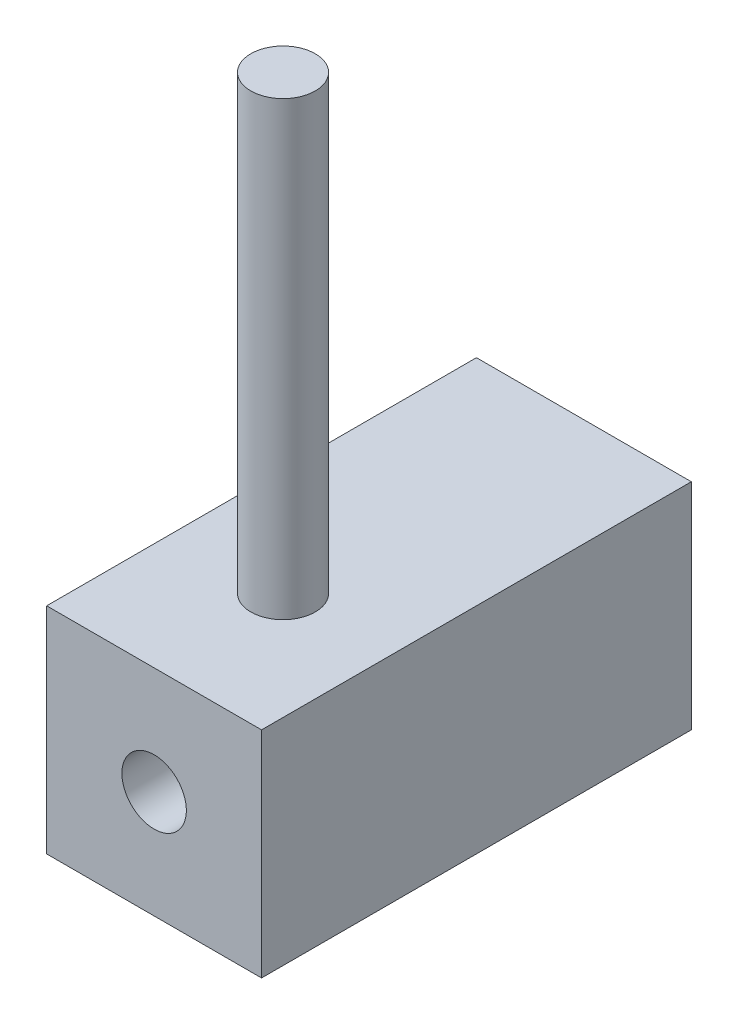
ISO-10303-21;
HEADER;
FILE_DESCRIPTION(('STEP AP214'),'2;1');
FILE_NAME('part.step','',(''),(''),'','','');
FILE_SCHEMA(('AUTOMOTIVE_DESIGN { 1 0 10303 214 1 1 1 1 }'));
ENDSEC;
DATA;
#1=APPLICATION_CONTEXT('core data for automotive mechanical design processes');
#2=APPLICATION_PROTOCOL_DEFINITION('international standard','automotive_design',2000,#1);
#3=PRODUCT_CONTEXT('',#1,'mechanical');
#4=PRODUCT('Part','Part','',(#3));
#5=PRODUCT_RELATED_PRODUCT_CATEGORY('part','',(#4));
#6=PRODUCT_DEFINITION_FORMATION('','',#4);
#7=PRODUCT_DEFINITION_CONTEXT('part definition',#1,'design');
#8=PRODUCT_DEFINITION('design','',#6,#7);
#9=PRODUCT_DEFINITION_SHAPE('','',#8);
#10=(LENGTH_UNIT() NAMED_UNIT(*) SI_UNIT(.MILLI.,.METRE.));
#11=(NAMED_UNIT(*) PLANE_ANGLE_UNIT() SI_UNIT($,.RADIAN.));
#12=(NAMED_UNIT(*) SI_UNIT($,.STERADIAN.) SOLID_ANGLE_UNIT());
#13=UNCERTAINTY_MEASURE_WITH_UNIT(LENGTH_MEASURE(1.E-05),#10,'distance_accuracy_value','');
#14=(GEOMETRIC_REPRESENTATION_CONTEXT(3) GLOBAL_UNCERTAINTY_ASSIGNED_CONTEXT((#13)) GLOBAL_UNIT_ASSIGNED_CONTEXT((#10,
#11,#12)) REPRESENTATION_CONTEXT('',''));
#15=CARTESIAN_POINT('',(0.,0.,0.));
#16=DIRECTION('',(0.,0.,1.));
#17=DIRECTION('',(1.,0.,0.));
#18=AXIS2_PLACEMENT_3D('',#15,#16,#17);
#19=CARTESIAN_POINT('',(0.,10.,0.));
#20=DIRECTION('',(0.,1.,0.));
#21=DIRECTION('',(0.,0.,1.));
#22=AXIS2_PLACEMENT_3D('',#19,#20,#21);
#23=PLANE('',#22);
#24=DIRECTION('',(0.,0.,1.));
#25=VECTOR('',#24,1.);
#26=CARTESIAN_POINT('',(-4.97175141242937,10.,-2.51412429378531));
#27=LINE('',#26,#25);
#28=CARTESIAN_POINT('',(-4.97175141242937,10.,-2.51412429378531));
#29=VERTEX_POINT('',#28);
#30=CARTESIAN_POINT('',(-4.97175141242937,10.,17.4858757062147));
#31=VERTEX_POINT('',#30);
#32=EDGE_CURVE('E85',#29,#31,#27,.T.);
#33=ORIENTED_EDGE('',*,*,#32,.T.);
#34=DIRECTION('',(1.,0.,0.));
#35=VECTOR('',#34,1.);
#36=CARTESIAN_POINT('',(-4.97175141242937,10.,17.4858757062147));
#37=LINE('',#36,#35);
#38=CARTESIAN_POINT('',(5.02824858757063,10.,17.4858757062147));
#39=VERTEX_POINT('',#38);
#40=EDGE_CURVE('E80',#31,#39,#37,.T.);
#41=ORIENTED_EDGE('',*,*,#40,.T.);
#42=DIRECTION('',(0.,0.,-1.));
#43=VECTOR('',#42,1.);
#44=CARTESIAN_POINT('',(5.02824858757063,10.,-2.51412429378531));
#45=LINE('',#44,#43);
#46=CARTESIAN_POINT('',(5.02824858757063,10.,-2.51412429378531));
#47=VERTEX_POINT('',#46);
#48=EDGE_CURVE('E83',#39,#47,#45,.T.);
#49=ORIENTED_EDGE('',*,*,#48,.T.);
#50=DIRECTION('',(-1.,0.,0.));
#51=VECTOR('',#50,1.);
#52=CARTESIAN_POINT('',(-4.97175141242937,10.,-2.51412429378531));
#53=LINE('',#52,#51);
#54=EDGE_CURVE('E50',#47,#29,#53,.T.);
#55=ORIENTED_EDGE('',*,*,#54,.T.);
#56=EDGE_LOOP('',(#33,#41,#49,#55));
#57=FACE_BOUND('',#56,.T.);
#58=CARTESIAN_POINT('',(0.0282485875706274,10.,11.4858757062147));
#59=DIRECTION('',(0.,1.,0.));
#60=DIRECTION('',(0.,0.,1.));
#61=AXIS2_PLACEMENT_3D('',#58,#59,#60);
#62=CIRCLE('',#61,1.5);
#63=CARTESIAN_POINT('',(0.0282485875706274,10.,12.9858757062147));
#64=VERTEX_POINT('',#63);
#65=EDGE_CURVE('E117',#64,#64,#62,.T.);
#66=ORIENTED_EDGE('',*,*,#65,.F.);
#67=EDGE_LOOP('',(#66));
#68=FACE_BOUND('',#67,.T.);
#69=ADVANCED_FACE('F33',(#57,#68),#23,.T.);
#70=CARTESIAN_POINT('',(-4.97175141242937,10.,-2.51412429378531));
#71=DIRECTION('',(1.,0.,0.));
#72=DIRECTION('',(0.,0.,-1.));
#73=AXIS2_PLACEMENT_3D('',#70,#71,#72);
#74=PLANE('',#73);
#75=DIRECTION('',(0.,0.,1.));
#76=VECTOR('',#75,1.);
#77=CARTESIAN_POINT('',(-4.97175141242937,0.,-2.51412429378531));
#78=LINE('',#77,#76);
#79=CARTESIAN_POINT('',(-4.97175141242937,0.,-2.51412429378531));
#80=VERTEX_POINT('',#79);
#81=CARTESIAN_POINT('',(-4.97175141242937,0.,17.4858757062147));
#82=VERTEX_POINT('',#81);
#83=EDGE_CURVE('E97',#80,#82,#78,.T.);
#84=ORIENTED_EDGE('',*,*,#83,.T.);
#85=DIRECTION('',(0.,-1.,0.));
#86=VECTOR('',#85,1.);
#87=CARTESIAN_POINT('',(-4.97175141242937,10.,17.4858757062147));
#88=LINE('',#87,#86);
#89=EDGE_CURVE('E11',#31,#82,#88,.T.);
#90=ORIENTED_EDGE('',*,*,#89,.F.);
#91=ORIENTED_EDGE('',*,*,#32,.F.);
#92=DIRECTION('',(0.,-1.,0.));
#93=VECTOR('',#92,1.);
#94=CARTESIAN_POINT('',(-4.97175141242937,10.,-2.51412429378531));
#95=LINE('',#94,#93);
#96=EDGE_CURVE('E93',#29,#80,#95,.T.);
#97=ORIENTED_EDGE('',*,*,#96,.T.);
#98=EDGE_LOOP('',(#84,#90,#91,#97));
#99=FACE_BOUND('',#98,.T.);
#100=ADVANCED_FACE('F35',(#99),#74,.F.);
#101=CARTESIAN_POINT('',(-4.97175141242937,10.,17.4858757062147));
#102=DIRECTION('',(0.,0.,-1.));
#103=DIRECTION('',(-1.,0.,0.));
#104=AXIS2_PLACEMENT_3D('',#101,#102,#103);
#105=PLANE('',#104);
#106=CARTESIAN_POINT('',(0.0282485875706265,5.,17.4858757062147));
#107=DIRECTION('',(0.,0.,-1.));
#108=DIRECTION('',(-1.,0.,0.));
#109=AXIS2_PLACEMENT_3D('',#106,#107,#108);
#110=CIRCLE('',#109,1.5);
#111=CARTESIAN_POINT('',(-1.47175141242937,5.,17.4858757062147));
#112=VERTEX_POINT('',#111);
#113=EDGE_CURVE('E100',#112,#112,#110,.T.);
#114=ORIENTED_EDGE('',*,*,#113,.T.);
#115=EDGE_LOOP('',(#114));
#116=FACE_BOUND('',#115,.T.);
#117=DIRECTION('',(1.,0.,0.));
#118=VECTOR('',#117,1.);
#119=CARTESIAN_POINT('',(-4.97175141242937,0.,17.4858757062147));
#120=LINE('',#119,#118);
#121=CARTESIAN_POINT('',(5.02824858757063,0.,17.4858757062147));
#122=VERTEX_POINT('',#121);
#123=EDGE_CURVE('E89',#82,#122,#120,.T.);
#124=ORIENTED_EDGE('',*,*,#123,.T.);
#125=DIRECTION('',(0.,-1.,0.));
#126=VECTOR('',#125,1.);
#127=CARTESIAN_POINT('',(5.02824858757063,10.,17.4858757062147));
#128=LINE('',#127,#126);
#129=EDGE_CURVE('E42',#39,#122,#128,.T.);
#130=ORIENTED_EDGE('',*,*,#129,.F.);
#131=ORIENTED_EDGE('',*,*,#40,.F.);
#132=ORIENTED_EDGE('',*,*,#89,.T.);
#133=EDGE_LOOP('',(#124,#130,#131,#132));
#134=FACE_BOUND('',#133,.T.);
#135=ADVANCED_FACE('F88',(#116,#134),#105,.F.);
#136=CARTESIAN_POINT('',(5.02824858757063,10.,-2.51412429378531));
#137=DIRECTION('',(-1.,0.,0.));
#138=DIRECTION('',(0.,0.,1.));
#139=AXIS2_PLACEMENT_3D('',#136,#137,#138);
#140=PLANE('',#139);
#141=DIRECTION('',(0.,0.,-1.));
#142=VECTOR('',#141,1.);
#143=CARTESIAN_POINT('',(5.02824858757063,0.,-2.51412429378531));
#144=LINE('',#143,#142);
#145=CARTESIAN_POINT('',(5.02824858757063,0.,-2.51412429378531));
#146=VERTEX_POINT('',#145);
#147=EDGE_CURVE('E67',#122,#146,#144,.T.);
#148=ORIENTED_EDGE('',*,*,#147,.T.);
#149=DIRECTION('',(0.,-1.,0.));
#150=VECTOR('',#149,1.);
#151=CARTESIAN_POINT('',(5.02824858757063,10.,-2.51412429378531));
#152=LINE('',#151,#150);
#153=EDGE_CURVE('E90',#47,#146,#152,.T.);
#154=ORIENTED_EDGE('',*,*,#153,.F.);
#155=ORIENTED_EDGE('',*,*,#48,.F.);
#156=ORIENTED_EDGE('',*,*,#129,.T.);
#157=EDGE_LOOP('',(#148,#154,#155,#156));
#158=FACE_BOUND('',#157,.T.);
#159=ADVANCED_FACE('F91',(#158),#140,.F.);
#160=CARTESIAN_POINT('',(-4.97175141242937,10.,-2.51412429378531));
#161=DIRECTION('',(0.,0.,1.));
#162=DIRECTION('',(1.,0.,0.));
#163=AXIS2_PLACEMENT_3D('',#160,#161,#162);
#164=PLANE('',#163);
#165=CARTESIAN_POINT('',(0.0282485875706265,5.,-2.51412429378531));
#166=DIRECTION('',(0.,0.,-1.));
#167=DIRECTION('',(-1.,0.,0.));
#168=AXIS2_PLACEMENT_3D('',#165,#166,#167);
#169=CIRCLE('',#168,1.5);
#170=CARTESIAN_POINT('',(-1.47175141242937,5.,-2.51412429378531));
#171=VERTEX_POINT('',#170);
#172=EDGE_CURVE('E113',#171,#171,#169,.T.);
#173=ORIENTED_EDGE('',*,*,#172,.F.);
#174=EDGE_LOOP('',(#173));
#175=FACE_BOUND('',#174,.T.);
#176=DIRECTION('',(-1.,0.,0.));
#177=VECTOR('',#176,1.);
#178=CARTESIAN_POINT('',(-4.97175141242937,0.,-2.51412429378531));
#179=LINE('',#178,#177);
#180=EDGE_CURVE('E73',#146,#80,#179,.T.);
#181=ORIENTED_EDGE('',*,*,#180,.T.);
#182=ORIENTED_EDGE('',*,*,#96,.F.);
#183=ORIENTED_EDGE('',*,*,#54,.F.);
#184=ORIENTED_EDGE('',*,*,#153,.T.);
#185=EDGE_LOOP('',(#181,#182,#183,#184));
#186=FACE_BOUND('',#185,.T.);
#187=ADVANCED_FACE('F105',(#175,#186),#164,.F.);
#188=CARTESIAN_POINT('',(0.,0.,0.));
#189=DIRECTION('',(0.,1.,0.));
#190=DIRECTION('',(0.,0.,1.));
#191=AXIS2_PLACEMENT_3D('',#188,#189,#190);
#192=PLANE('',#191);
#193=ORIENTED_EDGE('',*,*,#83,.F.);
#194=ORIENTED_EDGE('',*,*,#180,.F.);
#195=ORIENTED_EDGE('',*,*,#147,.F.);
#196=ORIENTED_EDGE('',*,*,#123,.F.);
#197=EDGE_LOOP('',(#193,#194,#195,#196));
#198=FACE_BOUND('',#197,.T.);
#199=ADVANCED_FACE('F108',(#198),#192,.F.);
#200=CARTESIAN_POINT('',(0.0282485875706265,5.,18.4858757062147));
#201=DIRECTION('',(0.,0.,-1.));
#202=DIRECTION('',(-1.,0.,0.));
#203=AXIS2_PLACEMENT_3D('',#200,#201,#202);
#204=CYLINDRICAL_SURFACE('',#203,1.5);
#205=ORIENTED_EDGE('',*,*,#172,.T.);
#206=EDGE_LOOP('',(#205));
#207=FACE_BOUND('',#206,.T.);
#208=ORIENTED_EDGE('',*,*,#113,.F.);
#209=EDGE_LOOP('',(#208));
#210=FACE_BOUND('',#209,.T.);
#211=ADVANCED_FACE('F128',(#207,#210),#204,.F.);
#212=CARTESIAN_POINT('',(0.0282485875706274,31.,11.4858757062147));
#213=DIRECTION('',(0.,-1.,0.));
#214=DIRECTION('',(0.,0.,-1.));
#215=AXIS2_PLACEMENT_3D('',#212,#213,#214);
#216=CYLINDRICAL_SURFACE('',#215,1.5);
#217=CARTESIAN_POINT('',(0.0282485875706274,31.,11.4858757062147));
#218=DIRECTION('',(0.,1.,0.));
#219=DIRECTION('',(0.,0.,1.));
#220=AXIS2_PLACEMENT_3D('',#217,#218,#219);
#221=CIRCLE('',#220,1.5);
#222=CARTESIAN_POINT('',(0.0282485875706274,31.,12.9858757062147));
#223=VERTEX_POINT('',#222);
#224=EDGE_CURVE('E116',#223,#223,#221,.T.);
#225=ORIENTED_EDGE('',*,*,#224,.F.);
#226=EDGE_LOOP('',(#225));
#227=FACE_BOUND('',#226,.T.);
#228=ORIENTED_EDGE('',*,*,#65,.T.);
#229=EDGE_LOOP('',(#228));
#230=FACE_BOUND('',#229,.T.);
#231=ADVANCED_FACE('F125',(#227,#230),#216,.T.);
#232=CARTESIAN_POINT('',(0.0282485875706274,31.,11.4858757062147));
#233=DIRECTION('',(0.,1.,0.));
#234=DIRECTION('',(0.,0.,1.));
#235=AXIS2_PLACEMENT_3D('',#232,#233,#234);
#236=PLANE('',#235);
#237=ORIENTED_EDGE('',*,*,#224,.T.);
#238=EDGE_LOOP('',(#237));
#239=FACE_BOUND('',#238,.T.);
#240=ADVANCED_FACE('F123',(#239),#236,.T.);
#241=CLOSED_SHELL('',(#69,#100,#135,#159,#187,#199,#211,#231,#240));
#242=MANIFOLD_SOLID_BREP('B2',#241);
#243=ADVANCED_BREP_SHAPE_REPRESENTATION('',(#18,#242),#14);
#244=SHAPE_DEFINITION_REPRESENTATION(#9,#243);
ENDSEC;
END-ISO-10303-21;
